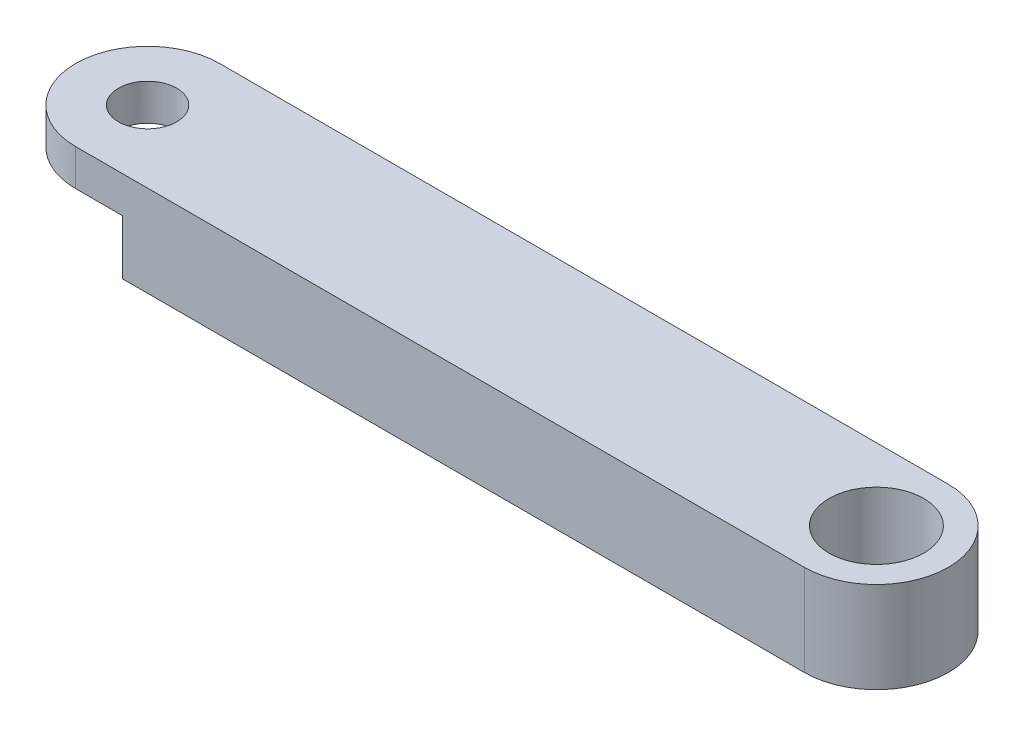
ISO-10303-21;
HEADER;
FILE_DESCRIPTION(('STEP AP214'),'2;1');
FILE_NAME('part.step','',(''),(''),'','','');
FILE_SCHEMA(('AUTOMOTIVE_DESIGN { 1 0 10303 214 1 1 1 1 }'));
ENDSEC;
DATA;
#1=APPLICATION_CONTEXT('core data for automotive mechanical design processes');
#2=APPLICATION_PROTOCOL_DEFINITION('international standard','automotive_design',2000,#1);
#3=PRODUCT_CONTEXT('',#1,'mechanical');
#4=PRODUCT('Part','Part','',(#3));
#5=PRODUCT_RELATED_PRODUCT_CATEGORY('part','',(#4));
#6=PRODUCT_DEFINITION_FORMATION('','',#4);
#7=PRODUCT_DEFINITION_CONTEXT('part definition',#1,'design');
#8=PRODUCT_DEFINITION('design','',#6,#7);
#9=PRODUCT_DEFINITION_SHAPE('','',#8);
#10=(LENGTH_UNIT() NAMED_UNIT(*) SI_UNIT(.MILLI.,.METRE.));
#11=(NAMED_UNIT(*) PLANE_ANGLE_UNIT() SI_UNIT($,.RADIAN.));
#12=(NAMED_UNIT(*) SI_UNIT($,.STERADIAN.) SOLID_ANGLE_UNIT());
#13=UNCERTAINTY_MEASURE_WITH_UNIT(LENGTH_MEASURE(1.E-05),#10,'distance_accuracy_value','');
#14=(GEOMETRIC_REPRESENTATION_CONTEXT(3) GLOBAL_UNCERTAINTY_ASSIGNED_CONTEXT((#13)) GLOBAL_UNIT_ASSIGNED_CONTEXT((#10,
#11,#12)) REPRESENTATION_CONTEXT('',''));
#15=CARTESIAN_POINT('',(0.,0.,0.));
#16=DIRECTION('',(0.,0.,1.));
#17=DIRECTION('',(1.,0.,0.));
#18=AXIS2_PLACEMENT_3D('',#15,#16,#17);
#19=CARTESIAN_POINT('',(0.,5.,0.));
#20=DIRECTION('',(0.,-1.,0.));
#21=DIRECTION('',(0.,0.,-1.));
#22=AXIS2_PLACEMENT_3D('',#19,#20,#21);
#23=CYLINDRICAL_SURFACE('',#22,3.95);
#24=CARTESIAN_POINT('',(0.,3.,0.));
#25=DIRECTION('',(0.,-1.,0.));
#26=DIRECTION('',(0.,0.,-1.));
#27=AXIS2_PLACEMENT_3D('',#24,#25,#26);
#28=CIRCLE('',#27,3.95);
#29=CARTESIAN_POINT('',(0.,3.,3.95));
#30=VERTEX_POINT('',#29);
#31=CARTESIAN_POINT('',(0.,3.,-3.95));
#32=VERTEX_POINT('',#31);
#33=EDGE_CURVE('E47',#30,#32,#28,.T.);
#34=ORIENTED_EDGE('',*,*,#33,.F.);
#35=DIRECTION('',(0.,-1.,0.));
#36=VECTOR('',#35,1.);
#37=CARTESIAN_POINT('',(0.,5.,3.95));
#38=LINE('',#37,#36);
#39=CARTESIAN_POINT('',(0.,5.,3.95));
#40=VERTEX_POINT('',#39);
#41=EDGE_CURVE('E11',#40,#30,#38,.T.);
#42=ORIENTED_EDGE('',*,*,#41,.F.);
#43=CARTESIAN_POINT('',(0.,5.,0.));
#44=DIRECTION('',(0.,1.,0.));
#45=DIRECTION('',(0.,0.,1.));
#46=AXIS2_PLACEMENT_3D('',#43,#44,#45);
#47=CIRCLE('',#46,3.95);
#48=CARTESIAN_POINT('',(0.,5.,-3.95));
#49=VERTEX_POINT('',#48);
#50=EDGE_CURVE('E130',#49,#40,#47,.T.);
#51=ORIENTED_EDGE('',*,*,#50,.F.);
#52=DIRECTION('',(0.,-1.,0.));
#53=VECTOR('',#52,1.);
#54=CARTESIAN_POINT('',(0.,5.,-3.95));
#55=LINE('',#54,#53);
#56=EDGE_CURVE('E137',#49,#32,#55,.T.);
#57=ORIENTED_EDGE('',*,*,#56,.T.);
#58=EDGE_LOOP('',(#34,#42,#51,#57));
#59=FACE_BOUND('',#58,.T.);
#60=ADVANCED_FACE('F33',(#59),#23,.T.);
#61=CARTESIAN_POINT('',(0.,5.,0.));
#62=DIRECTION('',(0.,-1.,0.));
#63=DIRECTION('',(0.,0.,-1.));
#64=AXIS2_PLACEMENT_3D('',#61,#62,#63);
#65=CYLINDRICAL_SURFACE('',#64,1.6);
#66=CARTESIAN_POINT('',(0.,5.,0.));
#67=DIRECTION('',(0.,1.,0.));
#68=DIRECTION('',(0.,0.,1.));
#69=AXIS2_PLACEMENT_3D('',#66,#67,#68);
#70=CIRCLE('',#69,1.6);
#71=CARTESIAN_POINT('',(0.,5.,1.6));
#72=VERTEX_POINT('',#71);
#73=EDGE_CURVE('E124',#72,#72,#70,.T.);
#74=ORIENTED_EDGE('',*,*,#73,.T.);
#75=EDGE_LOOP('',(#74));
#76=FACE_BOUND('',#75,.T.);
#77=CARTESIAN_POINT('',(0.,3.,0.));
#78=DIRECTION('',(0.,-1.,0.));
#79=DIRECTION('',(0.,0.,-1.));
#80=AXIS2_PLACEMENT_3D('',#77,#78,#79);
#81=CIRCLE('',#80,1.6);
#82=CARTESIAN_POINT('',(0.,3.,-1.6));
#83=VERTEX_POINT('',#82);
#84=EDGE_CURVE('E118',#83,#83,#81,.T.);
#85=ORIENTED_EDGE('',*,*,#84,.T.);
#86=EDGE_LOOP('',(#85));
#87=FACE_BOUND('',#86,.T.);
#88=ADVANCED_FACE('F158',(#76,#87),#65,.F.);
#89=CARTESIAN_POINT('',(0.,5.,0.));
#90=DIRECTION('',(0.,1.,0.));
#91=DIRECTION('',(0.,0.,1.));
#92=AXIS2_PLACEMENT_3D('',#89,#90,#91);
#93=PLANE('',#92);
#94=ORIENTED_EDGE('',*,*,#73,.F.);
#95=EDGE_LOOP('',(#94));
#96=FACE_BOUND('',#95,.T.);
#97=ORIENTED_EDGE('',*,*,#50,.T.);
#98=DIRECTION('',(1.,0.,0.));
#99=VECTOR('',#98,1.);
#100=CARTESIAN_POINT('',(0.,5.,3.95));
#101=LINE('',#100,#99);
#102=CARTESIAN_POINT('',(40.,5.,3.95));
#103=VERTEX_POINT('',#102);
#104=EDGE_CURVE('E79',#40,#103,#101,.T.);
#105=ORIENTED_EDGE('',*,*,#104,.T.);
#106=CARTESIAN_POINT('',(40.,5.,0.));
#107=DIRECTION('',(0.,1.,0.));
#108=DIRECTION('',(0.,0.,-1.));
#109=AXIS2_PLACEMENT_3D('',#106,#107,#108);
#110=CIRCLE('',#109,3.95);
#111=CARTESIAN_POINT('',(40.,5.,-3.95));
#112=VERTEX_POINT('',#111);
#113=EDGE_CURVE('E134',#103,#112,#110,.T.);
#114=ORIENTED_EDGE('',*,*,#113,.T.);
#115=DIRECTION('',(-1.,0.,0.));
#116=VECTOR('',#115,1.);
#117=CARTESIAN_POINT('',(0.,5.,-3.95));
#118=LINE('',#117,#116);
#119=EDGE_CURVE('E56',#112,#49,#118,.T.);
#120=ORIENTED_EDGE('',*,*,#119,.T.);
#121=EDGE_LOOP('',(#97,#105,#114,#120));
#122=FACE_BOUND('',#121,.T.);
#123=CARTESIAN_POINT('',(40.,5.,0.));
#124=DIRECTION('',(0.,1.,0.));
#125=DIRECTION('',(0.,0.,1.));
#126=AXIS2_PLACEMENT_3D('',#123,#124,#125);
#127=CIRCLE('',#126,2.6);
#128=CARTESIAN_POINT('',(40.,5.,2.6));
#129=VERTEX_POINT('',#128);
#130=EDGE_CURVE('E121',#129,#129,#127,.T.);
#131=ORIENTED_EDGE('',*,*,#130,.F.);
#132=EDGE_LOOP('',(#131));
#133=FACE_BOUND('',#132,.T.);
#134=ADVANCED_FACE('F155',(#96,#122,#133),#93,.T.);
#135=CARTESIAN_POINT('',(0.,0.,0.));
#136=DIRECTION('',(0.,1.,0.));
#137=DIRECTION('',(0.,0.,1.));
#138=AXIS2_PLACEMENT_3D('',#135,#136,#137);
#139=PLANE('',#138);
#140=DIRECTION('',(1.,0.,0.));
#141=VECTOR('',#140,1.);
#142=CARTESIAN_POINT('',(0.,0.,3.95));
#143=LINE('',#142,#141);
#144=CARTESIAN_POINT('',(2.56953303150592,0.,3.95));
#145=VERTEX_POINT('',#144);
#146=CARTESIAN_POINT('',(40.,0.,3.95));
#147=VERTEX_POINT('',#146);
#148=EDGE_CURVE('E129',#145,#147,#143,.T.);
#149=ORIENTED_EDGE('',*,*,#148,.F.);
#150=DIRECTION('',(0.,0.,1.));
#151=VECTOR('',#150,1.);
#152=CARTESIAN_POINT('',(2.56953303150592,0.,3.));
#153=LINE('',#152,#151);
#154=CARTESIAN_POINT('',(2.56953303150592,0.,-3.95));
#155=VERTEX_POINT('',#154);
#156=EDGE_CURVE('E100',#155,#145,#153,.T.);
#157=ORIENTED_EDGE('',*,*,#156,.F.);
#158=DIRECTION('',(-1.,0.,0.));
#159=VECTOR('',#158,1.);
#160=CARTESIAN_POINT('',(0.,0.,-3.95));
#161=LINE('',#160,#159);
#162=CARTESIAN_POINT('',(40.,0.,-3.95));
#163=VERTEX_POINT('',#162);
#164=EDGE_CURVE('E132',#163,#155,#161,.T.);
#165=ORIENTED_EDGE('',*,*,#164,.F.);
#166=CARTESIAN_POINT('',(40.,0.,0.));
#167=DIRECTION('',(0.,1.,0.));
#168=DIRECTION('',(0.,0.,-1.));
#169=AXIS2_PLACEMENT_3D('',#166,#167,#168);
#170=CIRCLE('',#169,3.95);
#171=EDGE_CURVE('E72',#147,#163,#170,.T.);
#172=ORIENTED_EDGE('',*,*,#171,.F.);
#173=EDGE_LOOP('',(#149,#157,#165,#172));
#174=FACE_BOUND('',#173,.T.);
#175=CARTESIAN_POINT('',(40.,0.,0.));
#176=DIRECTION('',(0.,1.,0.));
#177=DIRECTION('',(0.,0.,1.));
#178=AXIS2_PLACEMENT_3D('',#175,#176,#177);
#179=CIRCLE('',#178,2.6);
#180=CARTESIAN_POINT('',(40.,0.,2.6));
#181=VERTEX_POINT('',#180);
#182=EDGE_CURVE('E119',#181,#181,#179,.T.);
#183=ORIENTED_EDGE('',*,*,#182,.T.);
#184=EDGE_LOOP('',(#183));
#185=FACE_BOUND('',#184,.T.);
#186=ADVANCED_FACE('F149',(#174,#185),#139,.F.);
#187=CARTESIAN_POINT('',(0.,5.,3.95));
#188=DIRECTION('',(0.,0.,-1.));
#189=DIRECTION('',(-1.,0.,0.));
#190=AXIS2_PLACEMENT_3D('',#187,#188,#189);
#191=PLANE('',#190);
#192=DIRECTION('',(-1.,0.,0.));
#193=VECTOR('',#192,1.);
#194=CARTESIAN_POINT('',(2.56953303150592,3.,3.95));
#195=LINE('',#194,#193);
#196=CARTESIAN_POINT('',(2.56953303150592,3.,3.95));
#197=VERTEX_POINT('',#196);
#198=EDGE_CURVE('E107',#197,#30,#195,.T.);
#199=ORIENTED_EDGE('',*,*,#198,.F.);
#200=DIRECTION('',(0.,-1.,0.));
#201=VECTOR('',#200,1.);
#202=CARTESIAN_POINT('',(2.56953303150592,3.,3.95));
#203=LINE('',#202,#201);
#204=EDGE_CURVE('E95',#197,#145,#203,.T.);
#205=ORIENTED_EDGE('',*,*,#204,.T.);
#206=ORIENTED_EDGE('',*,*,#148,.T.);
#207=DIRECTION('',(0.,-1.,0.));
#208=VECTOR('',#207,1.);
#209=CARTESIAN_POINT('',(40.,5.,3.95));
#210=LINE('',#209,#208);
#211=EDGE_CURVE('E40',#103,#147,#210,.T.);
#212=ORIENTED_EDGE('',*,*,#211,.F.);
#213=ORIENTED_EDGE('',*,*,#104,.F.);
#214=ORIENTED_EDGE('',*,*,#41,.T.);
#215=EDGE_LOOP('',(#199,#205,#206,#212,#213,#214));
#216=FACE_BOUND('',#215,.T.);
#217=ADVANCED_FACE('F110',(#216),#191,.F.);
#218=CARTESIAN_POINT('',(40.,5.,0.));
#219=DIRECTION('',(0.,-1.,0.));
#220=DIRECTION('',(0.,0.,-1.));
#221=AXIS2_PLACEMENT_3D('',#218,#219,#220);
#222=CYLINDRICAL_SURFACE('',#221,3.95);
#223=ORIENTED_EDGE('',*,*,#171,.T.);
#224=DIRECTION('',(0.,-1.,0.));
#225=VECTOR('',#224,1.);
#226=CARTESIAN_POINT('',(40.,5.,-3.95));
#227=LINE('',#226,#225);
#228=EDGE_CURVE('E144',#112,#163,#227,.T.);
#229=ORIENTED_EDGE('',*,*,#228,.F.);
#230=ORIENTED_EDGE('',*,*,#113,.F.);
#231=ORIENTED_EDGE('',*,*,#211,.T.);
#232=EDGE_LOOP('',(#223,#229,#230,#231));
#233=FACE_BOUND('',#232,.T.);
#234=ADVANCED_FACE('F146',(#233),#222,.T.);
#235=CARTESIAN_POINT('',(0.,5.,-3.95));
#236=DIRECTION('',(0.,0.,1.));
#237=DIRECTION('',(1.,0.,0.));
#238=AXIS2_PLACEMENT_3D('',#235,#236,#237);
#239=PLANE('',#238);
#240=ORIENTED_EDGE('',*,*,#164,.T.);
#241=DIRECTION('',(0.,-1.,0.));
#242=VECTOR('',#241,1.);
#243=CARTESIAN_POINT('',(2.56953303150592,3.,-3.95));
#244=LINE('',#243,#242);
#245=CARTESIAN_POINT('',(2.56953303150592,3.,-3.95));
#246=VERTEX_POINT('',#245);
#247=EDGE_CURVE('E103',#246,#155,#244,.T.);
#248=ORIENTED_EDGE('',*,*,#247,.F.);
#249=DIRECTION('',(1.,0.,0.));
#250=VECTOR('',#249,1.);
#251=CARTESIAN_POINT('',(2.56953303150592,3.,-3.95));
#252=LINE('',#251,#250);
#253=EDGE_CURVE('E104',#32,#246,#252,.T.);
#254=ORIENTED_EDGE('',*,*,#253,.F.);
#255=ORIENTED_EDGE('',*,*,#56,.F.);
#256=ORIENTED_EDGE('',*,*,#119,.F.);
#257=ORIENTED_EDGE('',*,*,#228,.T.);
#258=EDGE_LOOP('',(#240,#248,#254,#255,#256,#257));
#259=FACE_BOUND('',#258,.T.);
#260=ADVANCED_FACE('F152',(#259),#239,.F.);
#261=CARTESIAN_POINT('',(40.,5.,0.));
#262=DIRECTION('',(0.,-1.,0.));
#263=DIRECTION('',(0.,0.,-1.));
#264=AXIS2_PLACEMENT_3D('',#261,#262,#263);
#265=CYLINDRICAL_SURFACE('',#264,2.6);
#266=ORIENTED_EDGE('',*,*,#130,.T.);
#267=EDGE_LOOP('',(#266));
#268=FACE_BOUND('',#267,.T.);
#269=ORIENTED_EDGE('',*,*,#182,.F.);
#270=EDGE_LOOP('',(#269));
#271=FACE_BOUND('',#270,.T.);
#272=ADVANCED_FACE('F163',(#268,#271),#265,.F.);
#273=CARTESIAN_POINT('',(2.56953303150592,3.,3.));
#274=DIRECTION('',(1.,0.,0.));
#275=DIRECTION('',(0.,0.,-1.));
#276=AXIS2_PLACEMENT_3D('',#273,#274,#275);
#277=PLANE('',#276);
#278=ORIENTED_EDGE('',*,*,#156,.T.);
#279=ORIENTED_EDGE('',*,*,#204,.F.);
#280=DIRECTION('',(0.,0.,1.));
#281=VECTOR('',#280,1.);
#282=CARTESIAN_POINT('',(2.56953303150592,3.,3.));
#283=LINE('',#282,#281);
#284=EDGE_CURVE('E98',#246,#197,#283,.T.);
#285=ORIENTED_EDGE('',*,*,#284,.F.);
#286=ORIENTED_EDGE('',*,*,#247,.T.);
#287=EDGE_LOOP('',(#278,#279,#285,#286));
#288=FACE_BOUND('',#287,.T.);
#289=ADVANCED_FACE('F97',(#288),#277,.F.);
#290=CARTESIAN_POINT('',(0.,3.,0.));
#291=DIRECTION('',(0.,-1.,0.));
#292=DIRECTION('',(0.,0.,-1.));
#293=AXIS2_PLACEMENT_3D('',#290,#291,#292);
#294=PLANE('',#293);
#295=ORIENTED_EDGE('',*,*,#84,.F.);
#296=EDGE_LOOP('',(#295));
#297=FACE_BOUND('',#296,.T.);
#298=ORIENTED_EDGE('',*,*,#284,.T.);
#299=ORIENTED_EDGE('',*,*,#198,.T.);
#300=ORIENTED_EDGE('',*,*,#33,.T.);
#301=ORIENTED_EDGE('',*,*,#253,.T.);
#302=EDGE_LOOP('',(#298,#299,#300,#301));
#303=FACE_BOUND('',#302,.T.);
#304=ADVANCED_FACE('F106',(#297,#303),#294,.T.);
#305=CLOSED_SHELL('',(#60,#88,#134,#186,#217,#234,#260,#272,#289,#304));
#306=MANIFOLD_SOLID_BREP('B2',#305);
#307=ADVANCED_BREP_SHAPE_REPRESENTATION('',(#18,#306),#14);
#308=SHAPE_DEFINITION_REPRESENTATION(#9,#307);
ENDSEC;
END-ISO-10303-21;
